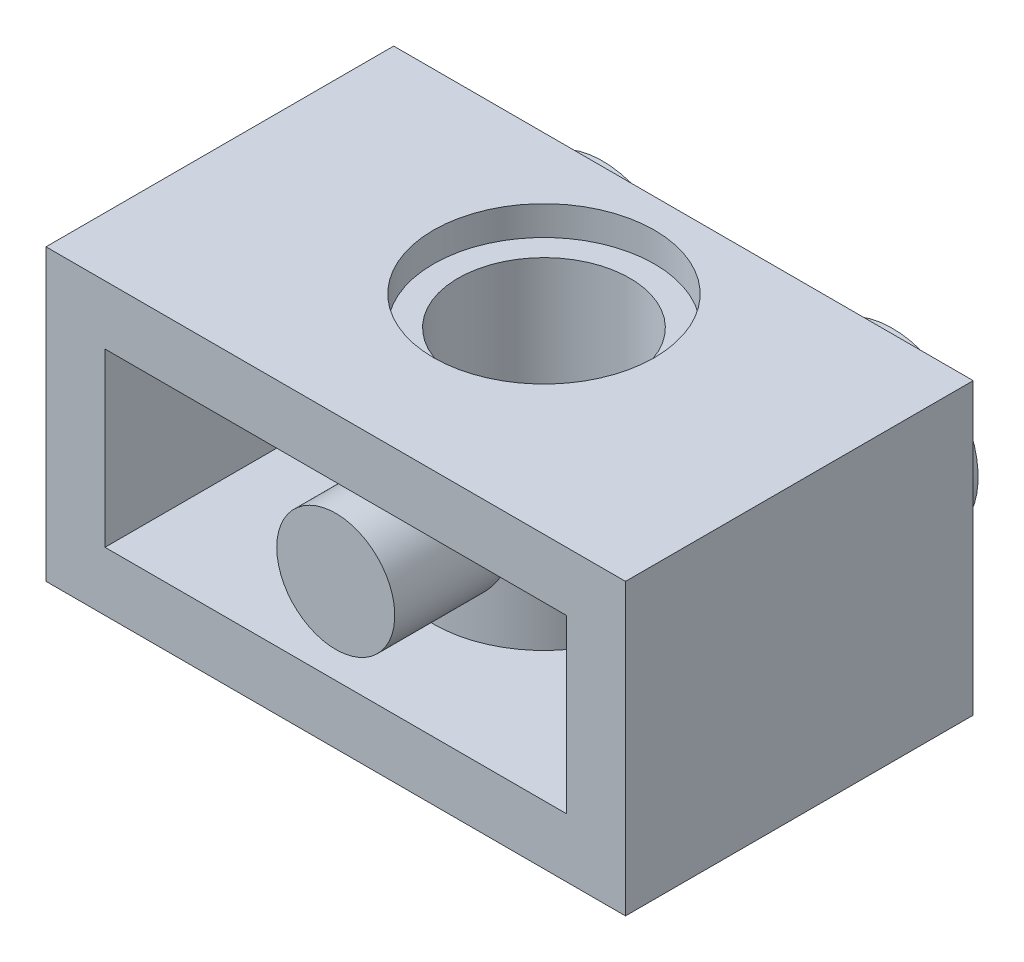
ISO-10303-21;
HEADER;
FILE_DESCRIPTION(('STEP AP214'),'2;1');
FILE_NAME('part.step','',(''),(''),'','','');
FILE_SCHEMA(('AUTOMOTIVE_DESIGN { 1 0 10303 214 1 1 1 1 }'));
ENDSEC;
DATA;
#1=APPLICATION_CONTEXT('core data for automotive mechanical design processes');
#2=APPLICATION_PROTOCOL_DEFINITION('international standard','automotive_design',2000,#1);
#3=PRODUCT_CONTEXT('',#1,'mechanical');
#4=PRODUCT('Part','Part','',(#3));
#5=PRODUCT_RELATED_PRODUCT_CATEGORY('part','',(#4));
#6=PRODUCT_DEFINITION_FORMATION('','',#4);
#7=PRODUCT_DEFINITION_CONTEXT('part definition',#1,'design');
#8=PRODUCT_DEFINITION('design','',#6,#7);
#9=PRODUCT_DEFINITION_SHAPE('','',#8);
#10=(LENGTH_UNIT() NAMED_UNIT(*) SI_UNIT(.MILLI.,.METRE.));
#11=(NAMED_UNIT(*) PLANE_ANGLE_UNIT() SI_UNIT($,.RADIAN.));
#12=(NAMED_UNIT(*) SI_UNIT($,.STERADIAN.) SOLID_ANGLE_UNIT());
#13=UNCERTAINTY_MEASURE_WITH_UNIT(LENGTH_MEASURE(1.E-05),#10,'distance_accuracy_value','');
#14=(GEOMETRIC_REPRESENTATION_CONTEXT(3) GLOBAL_UNCERTAINTY_ASSIGNED_CONTEXT((#13)) GLOBAL_UNIT_ASSIGNED_CONTEXT((#10,
#11,#12)) REPRESENTATION_CONTEXT('',''));
#15=CARTESIAN_POINT('',(0.,0.,0.));
#16=DIRECTION('',(0.,0.,1.));
#17=DIRECTION('',(1.,0.,0.));
#18=AXIS2_PLACEMENT_3D('',#15,#16,#17);
#19=CARTESIAN_POINT('',(6.4225,2.39,-3.1965));
#20=DIRECTION('',(0.,1.,0.));
#21=DIRECTION('',(0.,0.,1.));
#22=AXIS2_PLACEMENT_3D('',#19,#20,#21);
#23=PLANE('',#22);
#24=CARTESIAN_POINT('',(-7.50715418505547E-13,2.39,-0.955999999999999));
#25=DIRECTION('',(0.,-1.,0.));
#26=DIRECTION('',(0.,0.,1.));
#27=AXIS2_PLACEMENT_3D('',#24,#25,#26);
#28=CIRCLE('',#27,3.07500000000066);
#29=CARTESIAN_POINT('',(2.10613027849678,2.39,-3.1965));
#30=VERTEX_POINT('',#29);
#31=CARTESIAN_POINT('',(-2.10613027849828,2.39,-3.1965));
#32=VERTEX_POINT('',#31);
#33=EDGE_CURVE('E57',#30,#32,#28,.T.);
#34=ORIENTED_EDGE('',*,*,#33,.F.);
#35=DIRECTION('',(-1.,0.,0.));
#36=VECTOR('',#35,1.);
#37=CARTESIAN_POINT('',(6.4225,2.39,-3.1965));
#38=LINE('',#37,#36);
#39=CARTESIAN_POINT('',(6.4225,2.39,-3.1965));
#40=VERTEX_POINT('',#39);
#41=EDGE_CURVE('E145',#40,#30,#38,.T.);
#42=ORIENTED_EDGE('',*,*,#41,.F.);
#43=DIRECTION('',(0.,0.,1.));
#44=VECTOR('',#43,1.);
#45=CARTESIAN_POINT('',(6.4225,2.39,-3.1965));
#46=LINE('',#45,#44);
#47=CARTESIAN_POINT('',(6.4225,2.39,4.839));
#48=VERTEX_POINT('',#47);
#49=EDGE_CURVE('E162',#40,#48,#46,.T.);
#50=ORIENTED_EDGE('',*,*,#49,.T.);
#51=DIRECTION('',(-1.,0.,0.));
#52=VECTOR('',#51,1.);
#53=CARTESIAN_POINT('',(6.4225,2.39,4.839));
#54=LINE('',#53,#52);
#55=CARTESIAN_POINT('',(-6.4225,2.39,4.839));
#56=VERTEX_POINT('',#55);
#57=EDGE_CURVE('E156',#48,#56,#54,.T.);
#58=ORIENTED_EDGE('',*,*,#57,.T.);
#59=DIRECTION('',(0.,0.,1.));
#60=VECTOR('',#59,1.);
#61=CARTESIAN_POINT('',(-6.4225,2.39,-3.1965));
#62=LINE('',#61,#60);
#63=CARTESIAN_POINT('',(-6.4225,2.39,-3.1965));
#64=VERTEX_POINT('',#63);
#65=EDGE_CURVE('E159',#64,#56,#62,.T.);
#66=ORIENTED_EDGE('',*,*,#65,.F.);
#67=EDGE_CURVE('E141',#32,#64,#38,.T.);
#68=ORIENTED_EDGE('',*,*,#67,.F.);
#69=EDGE_LOOP('',(#34,#42,#50,#58,#66,#68));
#70=FACE_BOUND('',#69,.T.);
#71=ADVANCED_FACE('F37',(#70),#23,.F.);
#72=CARTESIAN_POINT('',(-6.4225,-2.39,-3.1965));
#73=DIRECTION('',(0.,-1.,0.));
#74=DIRECTION('',(0.,0.,-1.));
#75=AXIS2_PLACEMENT_3D('',#72,#73,#74);
#76=PLANE('',#75);
#77=CARTESIAN_POINT('',(-7.50715418505547E-13,-2.39,-0.955999999999999));
#78=DIRECTION('',(0.,-1.,0.));
#79=DIRECTION('',(0.,0.,1.));
#80=AXIS2_PLACEMENT_3D('',#77,#78,#79);
#81=CIRCLE('',#80,3.07500000000066);
#82=CARTESIAN_POINT('',(2.10613027849678,-2.39,-3.1965));
#83=VERTEX_POINT('',#82);
#84=CARTESIAN_POINT('',(-2.10613027849828,-2.39,-3.1965));
#85=VERTEX_POINT('',#84);
#86=EDGE_CURVE('E119',#83,#85,#81,.T.);
#87=ORIENTED_EDGE('',*,*,#86,.T.);
#88=DIRECTION('',(1.,0.,0.));
#89=VECTOR('',#88,1.);
#90=CARTESIAN_POINT('',(-6.4225,-2.39,-3.1965));
#91=LINE('',#90,#89);
#92=CARTESIAN_POINT('',(-6.4225,-2.39,-3.1965));
#93=VERTEX_POINT('',#92);
#94=EDGE_CURVE('E130',#93,#85,#91,.T.);
#95=ORIENTED_EDGE('',*,*,#94,.F.);
#96=DIRECTION('',(0.,0.,1.));
#97=VECTOR('',#96,1.);
#98=CARTESIAN_POINT('',(-6.4225,-2.39,-3.1965));
#99=LINE('',#98,#97);
#100=CARTESIAN_POINT('',(-6.4225,-2.39,4.839));
#101=VERTEX_POINT('',#100);
#102=EDGE_CURVE('E148',#93,#101,#99,.T.);
#103=ORIENTED_EDGE('',*,*,#102,.T.);
#104=DIRECTION('',(1.,0.,0.));
#105=VECTOR('',#104,1.);
#106=CARTESIAN_POINT('',(-6.4225,-2.39,4.839));
#107=LINE('',#106,#105);
#108=CARTESIAN_POINT('',(6.4225,-2.39,4.839));
#109=VERTEX_POINT('',#108);
#110=EDGE_CURVE('E150',#101,#109,#107,.T.);
#111=ORIENTED_EDGE('',*,*,#110,.T.);
#112=DIRECTION('',(0.,0.,1.));
#113=VECTOR('',#112,1.);
#114=CARTESIAN_POINT('',(6.4225,-2.39,-3.1965));
#115=LINE('',#114,#113);
#116=CARTESIAN_POINT('',(6.4225,-2.39,-3.1965));
#117=VERTEX_POINT('',#116);
#118=EDGE_CURVE('E164',#117,#109,#115,.T.);
#119=ORIENTED_EDGE('',*,*,#118,.F.);
#120=EDGE_CURVE('E133',#83,#117,#91,.T.);
#121=ORIENTED_EDGE('',*,*,#120,.F.);
#122=EDGE_LOOP('',(#87,#95,#103,#111,#119,#121));
#123=FACE_BOUND('',#122,.T.);
#124=ADVANCED_FACE('F129',(#123),#76,.F.);
#125=CARTESIAN_POINT('',(-6.4225,-2.39,-3.1965));
#126=DIRECTION('',(0.,0.,1.));
#127=DIRECTION('',(1.,0.,0.));
#128=AXIS2_PLACEMENT_3D('',#125,#126,#127);
#129=PLANE('',#128);
#130=ORIENTED_EDGE('',*,*,#41,.T.);
#131=DIRECTION('',(0.,1.,0.));
#132=VECTOR('',#131,1.);
#133=CARTESIAN_POINT('',(2.10613027849678,-2.39,-3.1965));
#134=LINE('',#133,#132);
#135=EDGE_CURVE('E124',#83,#30,#134,.T.);
#136=ORIENTED_EDGE('',*,*,#135,.F.);
#137=ORIENTED_EDGE('',*,*,#120,.T.);
#138=DIRECTION('',(0.,1.,0.));
#139=VECTOR('',#138,1.);
#140=CARTESIAN_POINT('',(6.4225,-2.39,-3.1965));
#141=LINE('',#140,#139);
#142=EDGE_CURVE('E138',#117,#40,#141,.T.);
#143=ORIENTED_EDGE('',*,*,#142,.T.);
#144=EDGE_LOOP('',(#130,#136,#137,#143));
#145=FACE_BOUND('',#144,.T.);
#146=ADVANCED_FACE('F244',(#145),#129,.T.);
#147=ORIENTED_EDGE('',*,*,#94,.T.);
#148=DIRECTION('',(0.,1.,0.));
#149=VECTOR('',#148,1.);
#150=CARTESIAN_POINT('',(-2.10613027849828,-2.39,-3.1965));
#151=LINE('',#150,#149);
#152=EDGE_CURVE('E116',#85,#32,#151,.T.);
#153=ORIENTED_EDGE('',*,*,#152,.T.);
#154=ORIENTED_EDGE('',*,*,#67,.T.);
#155=DIRECTION('',(0.,-1.,0.));
#156=VECTOR('',#155,1.);
#157=CARTESIAN_POINT('',(-6.4225,2.39,-3.1965));
#158=LINE('',#157,#156);
#159=EDGE_CURVE('E137',#64,#93,#158,.T.);
#160=ORIENTED_EDGE('',*,*,#159,.T.);
#161=EDGE_LOOP('',(#147,#153,#154,#160));
#162=FACE_BOUND('',#161,.T.);
#163=ADVANCED_FACE('F135',(#162),#129,.T.);
#164=CARTESIAN_POINT('',(-8.065,-4.0325,4.839));
#165=DIRECTION('',(0.,0.,1.));
#166=DIRECTION('',(1.,0.,0.));
#167=AXIS2_PLACEMENT_3D('',#164,#165,#166);
#168=PLANE('',#167);
#169=DIRECTION('',(0.,-1.,0.));
#170=VECTOR('',#169,1.);
#171=CARTESIAN_POINT('',(-6.4225,2.39,4.839));
#172=LINE('',#171,#170);
#173=EDGE_CURVE('E65',#56,#101,#172,.T.);
#174=ORIENTED_EDGE('',*,*,#173,.F.);
#175=ORIENTED_EDGE('',*,*,#57,.F.);
#176=DIRECTION('',(0.,1.,0.));
#177=VECTOR('',#176,1.);
#178=CARTESIAN_POINT('',(6.4225,-2.39,4.839));
#179=LINE('',#178,#177);
#180=EDGE_CURVE('E153',#109,#48,#179,.T.);
#181=ORIENTED_EDGE('',*,*,#180,.F.);
#182=ORIENTED_EDGE('',*,*,#110,.F.);
#183=EDGE_LOOP('',(#174,#175,#181,#182));
#184=FACE_BOUND('',#183,.T.);
#185=DIRECTION('',(1.,0.,0.));
#186=VECTOR('',#185,1.);
#187=CARTESIAN_POINT('',(-8.065,4.0325,4.839));
#188=LINE('',#187,#186);
#189=CARTESIAN_POINT('',(-8.065,4.0325,4.839));
#190=VERTEX_POINT('',#189);
#191=CARTESIAN_POINT('',(8.065,4.0325,4.839));
#192=VERTEX_POINT('',#191);
#193=EDGE_CURVE('E161',#190,#192,#188,.T.);
#194=ORIENTED_EDGE('',*,*,#193,.F.);
#195=DIRECTION('',(0.,1.,0.));
#196=VECTOR('',#195,1.);
#197=CARTESIAN_POINT('',(-8.065,-4.0325,4.839));
#198=LINE('',#197,#196);
#199=CARTESIAN_POINT('',(-8.065,-4.0325,4.839));
#200=VERTEX_POINT('',#199);
#201=EDGE_CURVE('E191',#200,#190,#198,.T.);
#202=ORIENTED_EDGE('',*,*,#201,.F.);
#203=DIRECTION('',(1.,0.,0.));
#204=VECTOR('',#203,1.);
#205=CARTESIAN_POINT('',(-8.065,-4.0325,4.839));
#206=LINE('',#205,#204);
#207=CARTESIAN_POINT('',(8.065,-4.0325,4.839));
#208=VERTEX_POINT('',#207);
#209=EDGE_CURVE('E167',#200,#208,#206,.T.);
#210=ORIENTED_EDGE('',*,*,#209,.T.);
#211=DIRECTION('',(0.,1.,0.));
#212=VECTOR('',#211,1.);
#213=CARTESIAN_POINT('',(8.065,-4.0325,4.839));
#214=LINE('',#213,#212);
#215=EDGE_CURVE('E180',#208,#192,#214,.T.);
#216=ORIENTED_EDGE('',*,*,#215,.T.);
#217=EDGE_LOOP('',(#194,#202,#210,#216));
#218=FACE_BOUND('',#217,.T.);
#219=ADVANCED_FACE('F39',(#184,#218),#168,.T.);
#220=CARTESIAN_POINT('',(-8.065,-4.0325,-4.839));
#221=DIRECTION('',(-1.,0.,0.));
#222=DIRECTION('',(0.,0.,1.));
#223=AXIS2_PLACEMENT_3D('',#220,#221,#222);
#224=PLANE('',#223);
#225=DIRECTION('',(0.,0.,1.));
#226=VECTOR('',#225,1.);
#227=CARTESIAN_POINT('',(-8.065,4.0325,-4.839));
#228=LINE('',#227,#226);
#229=CARTESIAN_POINT('',(-8.065,4.0325,-4.839));
#230=VERTEX_POINT('',#229);
#231=EDGE_CURVE('E171',#230,#190,#228,.T.);
#232=ORIENTED_EDGE('',*,*,#231,.F.);
#233=DIRECTION('',(0.,1.,0.));
#234=VECTOR('',#233,1.);
#235=CARTESIAN_POINT('',(-8.065,-4.0325,-4.839));
#236=LINE('',#235,#234);
#237=CARTESIAN_POINT('',(-8.065,-4.0325,-4.839));
#238=VERTEX_POINT('',#237);
#239=EDGE_CURVE('E194',#238,#230,#236,.T.);
#240=ORIENTED_EDGE('',*,*,#239,.F.);
#241=DIRECTION('',(0.,0.,1.));
#242=VECTOR('',#241,1.);
#243=CARTESIAN_POINT('',(-8.065,-4.0325,-4.839));
#244=LINE('',#243,#242);
#245=EDGE_CURVE('E177',#238,#200,#244,.T.);
#246=ORIENTED_EDGE('',*,*,#245,.T.);
#247=ORIENTED_EDGE('',*,*,#201,.T.);
#248=EDGE_LOOP('',(#232,#240,#246,#247));
#249=FACE_BOUND('',#248,.T.);
#250=ADVANCED_FACE('F210',(#249),#224,.T.);
#251=CARTESIAN_POINT('',(8.065,-4.0325,-4.839));
#252=DIRECTION('',(0.,0.,-1.));
#253=DIRECTION('',(-1.,0.,0.));
#254=AXIS2_PLACEMENT_3D('',#251,#252,#253);
#255=PLANE('',#254);
#256=CARTESIAN_POINT('',(-4.0325,0.,-4.839));
#257=DIRECTION('',(0.,0.,-1.));
#258=DIRECTION('',(-1.,0.,0.));
#259=AXIS2_PLACEMENT_3D('',#256,#257,#258);
#260=CIRCLE('',#259,2.39);
#261=CARTESIAN_POINT('',(-6.4225,0.,-4.839));
#262=VERTEX_POINT('',#261);
#263=EDGE_CURVE('E50',#262,#262,#260,.T.);
#264=ORIENTED_EDGE('',*,*,#263,.F.);
#265=EDGE_LOOP('',(#264));
#266=FACE_BOUND('',#265,.T.);
#267=CARTESIAN_POINT('',(4.0325,0.,-4.839));
#268=DIRECTION('',(0.,0.,-1.));
#269=DIRECTION('',(-1.,0.,0.));
#270=AXIS2_PLACEMENT_3D('',#267,#268,#269);
#271=CIRCLE('',#270,2.39);
#272=CARTESIAN_POINT('',(1.6425,0.,-4.839));
#273=VERTEX_POINT('',#272);
#274=EDGE_CURVE('E193',#273,#273,#271,.T.);
#275=ORIENTED_EDGE('',*,*,#274,.F.);
#276=EDGE_LOOP('',(#275));
#277=FACE_BOUND('',#276,.T.);
#278=DIRECTION('',(-1.,0.,0.));
#279=VECTOR('',#278,1.);
#280=CARTESIAN_POINT('',(8.065,4.0325,-4.839));
#281=LINE('',#280,#279);
#282=CARTESIAN_POINT('',(8.065,4.0325,-4.839));
#283=VERTEX_POINT('',#282);
#284=EDGE_CURVE('E186',#283,#230,#281,.T.);
#285=ORIENTED_EDGE('',*,*,#284,.F.);
#286=DIRECTION('',(0.,1.,0.));
#287=VECTOR('',#286,1.);
#288=CARTESIAN_POINT('',(8.065,-4.0325,-4.839));
#289=LINE('',#288,#287);
#290=CARTESIAN_POINT('',(8.065,-4.0325,-4.839));
#291=VERTEX_POINT('',#290);
#292=EDGE_CURVE('E196',#291,#283,#289,.T.);
#293=ORIENTED_EDGE('',*,*,#292,.F.);
#294=DIRECTION('',(-1.,0.,0.));
#295=VECTOR('',#294,1.);
#296=CARTESIAN_POINT('',(8.065,-4.0325,-4.839));
#297=LINE('',#296,#295);
#298=EDGE_CURVE('E174',#291,#238,#297,.T.);
#299=ORIENTED_EDGE('',*,*,#298,.T.);
#300=ORIENTED_EDGE('',*,*,#239,.T.);
#301=EDGE_LOOP('',(#285,#293,#299,#300));
#302=FACE_BOUND('',#301,.T.);
#303=ADVANCED_FACE('F206',(#266,#277,#302),#255,.T.);
#304=CARTESIAN_POINT('',(8.065,-4.0325,4.839));
#305=DIRECTION('',(1.,0.,0.));
#306=DIRECTION('',(0.,0.,-1.));
#307=AXIS2_PLACEMENT_3D('',#304,#305,#306);
#308=PLANE('',#307);
#309=DIRECTION('',(0.,0.,-1.));
#310=VECTOR('',#309,1.);
#311=CARTESIAN_POINT('',(8.065,4.0325,4.839));
#312=LINE('',#311,#310);
#313=EDGE_CURVE('E183',#192,#283,#312,.T.);
#314=ORIENTED_EDGE('',*,*,#313,.F.);
#315=ORIENTED_EDGE('',*,*,#215,.F.);
#316=DIRECTION('',(0.,0.,-1.));
#317=VECTOR('',#316,1.);
#318=CARTESIAN_POINT('',(8.065,-4.0325,4.839));
#319=LINE('',#318,#317);
#320=EDGE_CURVE('E170',#208,#291,#319,.T.);
#321=ORIENTED_EDGE('',*,*,#320,.T.);
#322=ORIENTED_EDGE('',*,*,#292,.T.);
#323=EDGE_LOOP('',(#314,#315,#321,#322));
#324=FACE_BOUND('',#323,.T.);
#325=ADVANCED_FACE('F209',(#324),#308,.T.);
#326=CARTESIAN_POINT('',(8.065,-4.0325,4.839));
#327=DIRECTION('',(0.,1.,0.));
#328=DIRECTION('',(0.,0.,1.));
#329=AXIS2_PLACEMENT_3D('',#326,#327,#328);
#330=PLANE('',#329);
#331=CARTESIAN_POINT('',(0.,-4.03249999999954,-0.956));
#332=DIRECTION('',(0.,1.,0.));
#333=DIRECTION('',(0.,0.,1.));
#334=AXIS2_PLACEMENT_3D('',#331,#332,#333);
#335=CIRCLE('',#334,3.075);
#336=CARTESIAN_POINT('',(0.,-4.03249999999954,2.119));
#337=VERTEX_POINT('',#336);
#338=EDGE_CURVE('E265',#337,#337,#335,.T.);
#339=ORIENTED_EDGE('',*,*,#338,.T.);
#340=EDGE_LOOP('',(#339));
#341=FACE_BOUND('',#340,.T.);
#342=ORIENTED_EDGE('',*,*,#209,.F.);
#343=ORIENTED_EDGE('',*,*,#245,.F.);
#344=ORIENTED_EDGE('',*,*,#298,.F.);
#345=ORIENTED_EDGE('',*,*,#320,.F.);
#346=EDGE_LOOP('',(#342,#343,#344,#345));
#347=FACE_BOUND('',#346,.T.);
#348=ADVANCED_FACE('F225',(#341,#347),#330,.F.);
#349=CARTESIAN_POINT('',(8.065,4.0325,4.839));
#350=DIRECTION('',(0.,1.,0.));
#351=DIRECTION('',(0.,0.,1.));
#352=AXIS2_PLACEMENT_3D('',#349,#350,#351);
#353=PLANE('',#352);
#354=CARTESIAN_POINT('',(0.,4.0325,-0.956));
#355=DIRECTION('',(0.,1.,0.));
#356=DIRECTION('',(0.,0.,1.));
#357=AXIS2_PLACEMENT_3D('',#354,#355,#356);
#358=CIRCLE('',#357,3.075);
#359=CARTESIAN_POINT('',(0.,4.0325,2.119));
#360=VERTEX_POINT('',#359);
#361=EDGE_CURVE('E263',#360,#360,#358,.T.);
#362=ORIENTED_EDGE('',*,*,#361,.F.);
#363=EDGE_LOOP('',(#362));
#364=FACE_BOUND('',#363,.T.);
#365=ORIENTED_EDGE('',*,*,#193,.T.);
#366=ORIENTED_EDGE('',*,*,#313,.T.);
#367=ORIENTED_EDGE('',*,*,#284,.T.);
#368=ORIENTED_EDGE('',*,*,#231,.T.);
#369=EDGE_LOOP('',(#365,#366,#367,#368));
#370=FACE_BOUND('',#369,.T.);
#371=ADVANCED_FACE('F219',(#364,#370),#353,.T.);
#372=CARTESIAN_POINT('',(-6.4225,2.39,-3.1965));
#373=DIRECTION('',(-1.,0.,0.));
#374=DIRECTION('',(0.,0.,1.));
#375=AXIS2_PLACEMENT_3D('',#372,#373,#374);
#376=PLANE('',#375);
#377=ORIENTED_EDGE('',*,*,#173,.T.);
#378=ORIENTED_EDGE('',*,*,#102,.F.);
#379=ORIENTED_EDGE('',*,*,#159,.F.);
#380=ORIENTED_EDGE('',*,*,#65,.T.);
#381=EDGE_LOOP('',(#377,#378,#379,#380));
#382=FACE_BOUND('',#381,.T.);
#383=ADVANCED_FACE('F249',(#382),#376,.F.);
#384=CARTESIAN_POINT('',(6.4225,-2.39,-3.1965));
#385=DIRECTION('',(1.,0.,0.));
#386=DIRECTION('',(0.,0.,-1.));
#387=AXIS2_PLACEMENT_3D('',#384,#385,#386);
#388=PLANE('',#387);
#389=ORIENTED_EDGE('',*,*,#180,.T.);
#390=ORIENTED_EDGE('',*,*,#49,.F.);
#391=ORIENTED_EDGE('',*,*,#142,.F.);
#392=ORIENTED_EDGE('',*,*,#118,.T.);
#393=EDGE_LOOP('',(#389,#390,#391,#392));
#394=FACE_BOUND('',#393,.T.);
#395=ADVANCED_FACE('F248',(#394),#388,.F.);
#396=CARTESIAN_POINT('',(-7.50715418505547E-13,-2.39,-0.955999999999999));
#397=DIRECTION('',(0.,1.,0.));
#398=DIRECTION('',(0.,0.,1.));
#399=AXIS2_PLACEMENT_3D('',#396,#397,#398);
#400=CYLINDRICAL_SURFACE('',#399,3.07500000000066);
#401=CARTESIAN_POINT('',(-1.642500000002,0.,1.64358049500299));
#402=CARTESIAN_POINT('',(-1.64249355963965,0.0846419026282318,1.64358916394284));
#403=CARTESIAN_POINT('',(-1.63591238827722,0.169368950769577,1.64777900722416));
#404=CARTESIAN_POINT('',(-1.60995885113341,0.336145632385499,1.6638997575945));
#405=CARTESIAN_POINT('',(-1.59056329685434,0.418190128607937,1.6758446973779));
#406=CARTESIAN_POINT('',(-1.54010667036438,0.576863014816299,1.70568018612205));
#407=CARTESIAN_POINT('',(-1.50911470334276,0.653520355477511,1.72353544309204));
#408=CARTESIAN_POINT('',(-1.43655730286428,0.800522778186878,1.76312331907909));
#409=CARTESIAN_POINT('',(-1.39499012967829,0.870866819054646,1.78485657589078));
#410=CARTESIAN_POINT('',(-1.29784578447152,1.01060043602089,1.83226250452832));
#411=CARTESIAN_POINT('',(-1.24131334828299,1.07926575144692,1.85811329479609));
#412=CARTESIAN_POINT('',(-1.11782055158812,1.20671592983289,1.90941021060064));
#413=CARTESIAN_POINT('',(-1.05085435396606,1.26549522359657,1.9348561007821));
#414=CARTESIAN_POINT('',(-0.901893164830069,1.37610494421595,1.98489422452432));
#415=CARTESIAN_POINT('',(-0.819126026503318,1.42700919593315,2.00925709420416));
#416=CARTESIAN_POINT('',(-0.644655610072859,1.51383563979799,2.05200360274914));
#417=CARTESIAN_POINT('',(-0.552958815115922,1.54976860287972,2.07039153811345));
#418=CARTESIAN_POINT('',(-0.370934604110247,1.60264433236737,2.09782050960068));
#419=CARTESIAN_POINT('',(-0.281075659912394,1.62086749020276,2.10748733193658));
#420=CARTESIAN_POINT('',(-0.0990998783825199,1.64205935256234,2.1187507369049));
#421=CARTESIAN_POINT('',(-0.00698468219320846,1.64503883221442,2.12035302001473));
#422=CARTESIAN_POINT('',(0.167108465501163,1.63606845900737,2.11556844844074));
#423=CARTESIAN_POINT('',(0.249187869388309,1.6255661924578,2.10995616398045));
#424=CARTESIAN_POINT('',(0.410212817337773,1.59257235871997,2.09259130373503));
#425=CARTESIAN_POINT('',(0.48915812265301,1.57007988002589,2.08083826112574));
#426=CARTESIAN_POINT('',(0.642909648294374,1.51369193877814,2.05207063754082));
#427=CARTESIAN_POINT('',(0.717655207896924,1.47966355768143,2.03499492148947));
#428=CARTESIAN_POINT('',(0.860534101925611,1.40140282596245,1.99706248974018));
#429=CARTESIAN_POINT('',(0.928665211375959,1.35716705854914,1.97620450847948));
#430=CARTESIAN_POINT('',(1.06393823224453,1.25450421083381,1.93004960331237));
#431=CARTESIAN_POINT('',(1.13024370396798,1.19508079168666,1.90451665249137));
#432=CARTESIAN_POINT('',(1.25243029556411,1.06635451109776,1.8531715785278));
#433=CARTESIAN_POINT('',(1.30830145447099,0.99704231967537,1.82735921325894));
#434=CARTESIAN_POINT('',(1.41245119312353,0.843821555181214,1.77607592730517));
#435=CARTESIAN_POINT('',(1.45977043813136,0.75919007682611,1.75079599522106));
#436=CARTESIAN_POINT('',(1.53916473892437,0.581560779333853,1.7064579348625));
#437=CARTESIAN_POINT('',(1.57125710646205,0.488572604912981,1.6873927486735));
#438=CARTESIAN_POINT('',(1.61653373696232,0.304698947010788,1.65993159321946));
#439=CARTESIAN_POINT('',(1.6310408842272,0.214255026304593,1.6507954612858));
#440=CARTESIAN_POINT('',(1.64473161869438,0.0317928283797412,1.64218431607379));
#441=CARTESIAN_POINT('',(1.64393018331642,-0.0602238220543194,1.64269985989973));
#442=CARTESIAN_POINT('',(1.62823947440064,-0.230074393496914,1.65254642362771));
#443=CARTESIAN_POINT('',(1.61524121531727,-0.308164659327785,1.66069389044483));
#444=CARTESIAN_POINT('',(1.57847518204379,-0.460861071827728,1.68303399198333));
#445=CARTESIAN_POINT('',(1.55470316340136,-0.535465832550139,1.69722900907766));
#446=CARTESIAN_POINT('',(1.49601284023467,-0.682881043721599,1.73077411239738));
#447=CARTESIAN_POINT('',(1.46064831663024,-0.755466439254046,1.75032431865995));
#448=CARTESIAN_POINT('',(1.38015035359206,-0.894105602880898,1.79224834243478));
#449=CARTESIAN_POINT('',(1.33501194901684,-0.96015602626458,1.81462359265476));
#450=CARTESIAN_POINT('',(1.22848264373521,-1.09407336520008,1.86364105237553));
#451=CARTESIAN_POINT('',(1.16567590476653,-1.16076735231783,1.89042532745651));
#452=CARTESIAN_POINT('',(1.02947943207752,-1.28310622241465,1.94246745277441));
#453=CARTESIAN_POINT('',(0.95608443308673,-1.33874557528915,1.96772453465674));
#454=CARTESIAN_POINT('',(0.796771661501489,-1.43951553647144,2.01518906271895));
#455=CARTESIAN_POINT('',(0.710457554932259,-1.4841069966937,2.03722399570713));
#456=CARTESIAN_POINT('',(0.530040282868016,-1.55766718297396,2.07436838554382));
#457=CARTESIAN_POINT('',(0.435944949409149,-1.58665140261646,2.08948470837394));
#458=CARTESIAN_POINT('',(0.252679948019545,-1.62537522298606,2.10984790301948));
#459=CARTESIAN_POINT('',(0.163945173655544,-1.63673626822429,2.11592384895147));
#460=CARTESIAN_POINT('',(-0.0143658567081445,-1.64485649102825,2.12025686090633));
#461=CARTESIAN_POINT('',(-0.103941703959649,-1.6416224287221,2.11851754678487));
#462=CARTESIAN_POINT('',(-0.273648269704471,-1.62161240655592,2.10788411595885));
#463=CARTESIAN_POINT('',(-0.353953677750068,-1.60596187450528,2.09958481756334));
#464=CARTESIAN_POINT('',(-0.510623379785833,-1.56322280176614,2.07734008857775));
#465=CARTESIAN_POINT('',(-0.586987174919382,-1.53613281724681,2.06339394528011));
#466=CARTESIAN_POINT('',(-0.736876335932698,-1.47029692546774,2.03042770960216));
#467=CARTESIAN_POINT('',(-0.81018741419228,-1.43115149995082,2.01123673975591));
#468=CARTESIAN_POINT('',(-0.949465669868662,-1.34280704877779,1.96965058588222));
#469=CARTESIAN_POINT('',(-1.01542967145505,-1.29360370136239,1.94725402569842));
#470=CARTESIAN_POINT('',(-1.14586740068001,-1.18028030523328,1.89846667251818));
#471=CARTESIAN_POINT('',(-1.20936982103126,-1.11511244588616,1.87190805555452));
#472=CARTESIAN_POINT('',(-1.32498379977393,-0.974929834968531,1.8196222373584));
#473=CARTESIAN_POINT('',(-1.37708271338508,-0.899904298697062,1.79389598575151));
#474=CARTESIAN_POINT('',(-1.47104522352846,-0.736988275974901,1.74485399494023));
#475=CARTESIAN_POINT('',(-1.51219581638133,-0.648619367138979,1.72174618365607));
#476=CARTESIAN_POINT('',(-1.57842411964503,-0.464616371257816,1.68326126327655));
#477=CARTESIAN_POINT('',(-1.60355434999283,-0.369007185657274,1.66785892925228));
#478=CARTESIAN_POINT('',(-1.62740029611988,-0.226806570861234,1.65307237115542));
#479=CARTESIAN_POINT('',(-1.63305062023679,-0.181714126724428,1.64953073727614));
#480=CARTESIAN_POINT('',(-1.64060227228953,-0.0910893542032187,1.64478242457749));
#481=CARTESIAN_POINT('',(-1.64250346641336,-0.0455570101764206,1.64357582909913));
#482=CARTESIAN_POINT('',(-1.642500000002,0.,1.64358049500299));
#483=B_SPLINE_CURVE_WITH_KNOTS('',3,(#401,#402,#403,#404,#405,#406,#407,#408,#409,#410,#411,
#412,#413,#414,#415,#416,#417,#418,#419,#420,#421,#422,#423,#424,#425,#426,#427,#428,#429,#430,
#431,#432,#433,#434,#435,#436,#437,#438,#439,#440,#441,#442,#443,#444,#445,#446,#447,#448,#449,
#450,#451,#452,#453,#454,#455,#456,#457,#458,#459,#460,#461,#462,#463,#464,#465,#466,#467,#468,
#469,#470,#471,#472,#473,#474,#475,#476,#477,#478,#479,#480,#481,#482),.UNSPECIFIED.,.T.,.F.,(4,
2,2,2,2,2,2,2,2,2,2,2,2,2,2,2,2,2,2,2,2,2,2,2,2,2,2,2,2,2,2,2,2,2,2,2,2,2,2,2,4),(0.,
0.253733028562708,0.507926466503564,0.760628637724607,1.0133724079389,1.29010443855302,
1.56699184512131,1.86592985122744,2.164652416645,2.43967655199714,2.71450625723699,
2.96215112198148,3.20981481557846,3.46043501022845,3.7111392187704,3.9878613282277,
4.26484627099156,4.5638952867901,4.86260348800741,5.13707522082567,5.41127843318709,
5.64895211863048,5.88671951998687,6.13499611458347,6.38339913108662,6.66849569748232,
6.95373452692979,7.25094649153692,7.54786286205283,7.81537788160388,8.08276900688783,
8.32836240144069,8.57398680284013,8.8288353017942,9.08379353691664,9.36694361350761,
9.65040608816907,9.94932496360272,10.2472587772026,10.3838212274598,10.5203885517447),.UNSPECIFIED.);
#484=CARTESIAN_POINT('',(-1.642500000002,0.,1.64358049500299));
#485=VERTEX_POINT('',#484);
#486=EDGE_CURVE('E11',#485,#485,#483,.T.);
#487=ORIENTED_EDGE('',*,*,#486,.T.);
#488=EDGE_LOOP('',(#487));
#489=FACE_BOUND('',#488,.T.);
#490=ORIENTED_EDGE('',*,*,#33,.T.);
#491=ORIENTED_EDGE('',*,*,#152,.F.);
#492=ORIENTED_EDGE('',*,*,#86,.F.);
#493=ORIENTED_EDGE('',*,*,#135,.T.);
#494=EDGE_LOOP('',(#490,#491,#492,#493));
#495=FACE_BOUND('',#494,.T.);
#496=ADVANCED_FACE('F118',(#489,#495),#400,.T.);
#497=CARTESIAN_POINT('',(4.0325,0.,-4.839));
#498=DIRECTION('',(0.,0.,-1.));
#499=DIRECTION('',(-1.,0.,0.));
#500=AXIS2_PLACEMENT_3D('',#497,#498,#499);
#501=CYLINDRICAL_SURFACE('',#500,2.39);
#502=ORIENTED_EDGE('',*,*,#274,.T.);
#503=EDGE_LOOP('',(#502));
#504=FACE_BOUND('',#503,.T.);
#505=CARTESIAN_POINT('',(4.0325,0.,-6.61899999999994));
#506=DIRECTION('',(0.,0.,-1.));
#507=DIRECTION('',(-1.,0.,0.));
#508=AXIS2_PLACEMENT_3D('',#505,#506,#507);
#509=CIRCLE('',#508,2.39);
#510=CARTESIAN_POINT('',(1.6425,0.,-6.61899999999994));
#511=VERTEX_POINT('',#510);
#512=EDGE_CURVE('E278',#511,#511,#509,.T.);
#513=ORIENTED_EDGE('',*,*,#512,.F.);
#514=EDGE_LOOP('',(#513));
#515=FACE_BOUND('',#514,.T.);
#516=ADVANCED_FACE('F299',(#504,#515),#501,.T.);
#517=CARTESIAN_POINT('',(4.0325,0.,-6.61899999999997));
#518=DIRECTION('',(0.,0.,-1.));
#519=DIRECTION('',(-1.,0.,0.));
#520=AXIS2_PLACEMENT_3D('',#517,#518,#519);
#521=PLANE('',#520);
#522=CARTESIAN_POINT('',(4.0325,0.,-6.61899999999997));
#523=DIRECTION('',(0.,0.,-1.));
#524=DIRECTION('',(-1.,0.,0.));
#525=AXIS2_PLACEMENT_3D('',#522,#523,#524);
#526=CIRCLE('',#525,1.64249999999999);
#527=CARTESIAN_POINT('',(2.39000000000001,0.,-6.61899999999997));
#528=VERTEX_POINT('',#527);
#529=EDGE_CURVE('E464',#528,#528,#526,.T.);
#530=ORIENTED_EDGE('',*,*,#529,.F.);
#531=EDGE_LOOP('',(#530));
#532=FACE_BOUND('',#531,.T.);
#533=ORIENTED_EDGE('',*,*,#512,.T.);
#534=EDGE_LOOP('',(#533));
#535=FACE_BOUND('',#534,.T.);
#536=ADVANCED_FACE('F302',(#532,#535),#521,.T.);
#537=CARTESIAN_POINT('',(-4.0325,0.,-4.839));
#538=DIRECTION('',(0.,0.,-1.));
#539=DIRECTION('',(-1.,0.,0.));
#540=AXIS2_PLACEMENT_3D('',#537,#538,#539);
#541=CYLINDRICAL_SURFACE('',#540,2.39);
#542=ORIENTED_EDGE('',*,*,#263,.T.);
#543=EDGE_LOOP('',(#542));
#544=FACE_BOUND('',#543,.T.);
#545=CARTESIAN_POINT('',(-4.0325,0.,-6.61899999999994));
#546=DIRECTION('',(0.,0.,-1.));
#547=DIRECTION('',(-1.,0.,0.));
#548=AXIS2_PLACEMENT_3D('',#545,#546,#547);
#549=CIRCLE('',#548,2.39);
#550=CARTESIAN_POINT('',(-6.4225,0.,-6.61899999999994));
#551=VERTEX_POINT('',#550);
#552=EDGE_CURVE('E269',#551,#551,#549,.T.);
#553=ORIENTED_EDGE('',*,*,#552,.F.);
#554=EDGE_LOOP('',(#553));
#555=FACE_BOUND('',#554,.T.);
#556=ADVANCED_FACE('F203',(#544,#555),#541,.T.);
#557=CARTESIAN_POINT('',(-4.0325,0.,-6.61899999999997));
#558=DIRECTION('',(0.,0.,-1.));
#559=DIRECTION('',(-1.,0.,0.));
#560=AXIS2_PLACEMENT_3D('',#557,#558,#559);
#561=PLANE('',#560);
#562=CARTESIAN_POINT('',(-4.0325,0.,-6.61899999999997));
#563=DIRECTION('',(0.,0.,-1.));
#564=DIRECTION('',(-1.,0.,0.));
#565=AXIS2_PLACEMENT_3D('',#562,#563,#564);
#566=CIRCLE('',#565,1.64249999999999);
#567=CARTESIAN_POINT('',(-5.67499999999999,0.,-6.61899999999997));
#568=VERTEX_POINT('',#567);
#569=EDGE_CURVE('E475',#568,#568,#566,.T.);
#570=ORIENTED_EDGE('',*,*,#569,.F.);
#571=EDGE_LOOP('',(#570));
#572=FACE_BOUND('',#571,.T.);
#573=ORIENTED_EDGE('',*,*,#552,.T.);
#574=EDGE_LOOP('',(#573));
#575=FACE_BOUND('',#574,.T.);
#576=ADVANCED_FACE('F317',(#572,#575),#561,.T.);
#577=CARTESIAN_POINT('',(0.,-4.03249999999954,-0.956));
#578=DIRECTION('',(0.,1.,0.));
#579=DIRECTION('',(0.,0.,1.));
#580=AXIS2_PLACEMENT_3D('',#577,#578,#579);
#581=CYLINDRICAL_SURFACE('',#580,3.075);
#582=ORIENTED_EDGE('',*,*,#338,.F.);
#583=EDGE_LOOP('',(#582));
#584=FACE_BOUND('',#583,.T.);
#585=CARTESIAN_POINT('',(0.,-3.2175,-0.956));
#586=DIRECTION('',(0.,1.,0.));
#587=DIRECTION('',(0.,0.,1.));
#588=AXIS2_PLACEMENT_3D('',#585,#586,#587);
#589=CIRCLE('',#588,3.075);
#590=CARTESIAN_POINT('',(0.,-3.2175,2.119));
#591=VERTEX_POINT('',#590);
#592=EDGE_CURVE('E481',#591,#591,#589,.T.);
#593=ORIENTED_EDGE('',*,*,#592,.T.);
#594=EDGE_LOOP('',(#593));
#595=FACE_BOUND('',#594,.T.);
#596=ADVANCED_FACE('F351',(#584,#595),#581,.F.);
#597=CARTESIAN_POINT('',(0.,-4.03249999999954,-0.956));
#598=DIRECTION('',(0.,1.,0.));
#599=DIRECTION('',(0.,0.,1.));
#600=AXIS2_PLACEMENT_3D('',#597,#598,#599);
#601=CYLINDRICAL_SURFACE('',#600,3.075);
#602=CARTESIAN_POINT('',(0.,3.21750000000046,-0.956));
#603=DIRECTION('',(0.,1.,0.));
#604=DIRECTION('',(0.,0.,1.));
#605=AXIS2_PLACEMENT_3D('',#602,#603,#604);
#606=CIRCLE('',#605,3.075);
#607=CARTESIAN_POINT('',(0.,3.21750000000046,2.119));
#608=VERTEX_POINT('',#607);
#609=EDGE_CURVE('E266',#608,#608,#606,.T.);
#610=ORIENTED_EDGE('',*,*,#609,.F.);
#611=EDGE_LOOP('',(#610));
#612=FACE_BOUND('',#611,.T.);
#613=ORIENTED_EDGE('',*,*,#361,.T.);
#614=EDGE_LOOP('',(#613));
#615=FACE_BOUND('',#614,.T.);
#616=ADVANCED_FACE('F359',(#612,#615),#601,.F.);
#617=CARTESIAN_POINT('',(3.075,3.21750000000046,-0.956));
#618=DIRECTION('',(0.,-1.,0.));
#619=DIRECTION('',(0.,0.,-1.));
#620=AXIS2_PLACEMENT_3D('',#617,#618,#619);
#621=PLANE('',#620);
#622=CARTESIAN_POINT('',(0.,3.21750000000046,-0.956));
#623=DIRECTION('',(0.,1.,0.));
#624=DIRECTION('',(0.,0.,1.));
#625=AXIS2_PLACEMENT_3D('',#622,#623,#624);
#626=CIRCLE('',#625,2.39);
#627=CARTESIAN_POINT('',(0.,3.21750000000046,1.434));
#628=VERTEX_POINT('',#627);
#629=EDGE_CURVE('E272',#628,#628,#626,.T.);
#630=ORIENTED_EDGE('',*,*,#629,.F.);
#631=EDGE_LOOP('',(#630));
#632=FACE_BOUND('',#631,.T.);
#633=ORIENTED_EDGE('',*,*,#609,.T.);
#634=EDGE_LOOP('',(#633));
#635=FACE_BOUND('',#634,.T.);
#636=ADVANCED_FACE('F367',(#632,#635),#621,.F.);
#637=CARTESIAN_POINT('',(0.,-4.03249999999954,-0.956));
#638=DIRECTION('',(0.,1.,0.));
#639=DIRECTION('',(0.,0.,1.));
#640=AXIS2_PLACEMENT_3D('',#637,#638,#639);
#641=CYLINDRICAL_SURFACE('',#640,2.39);
#642=CARTESIAN_POINT('',(0.,-3.21749999999999,-0.956));
#643=DIRECTION('',(0.,1.,0.));
#644=DIRECTION('',(0.,0.,1.));
#645=AXIS2_PLACEMENT_3D('',#642,#643,#644);
#646=CIRCLE('',#645,2.39);
#647=CARTESIAN_POINT('',(0.,-3.21749999999999,1.434));
#648=VERTEX_POINT('',#647);
#649=EDGE_CURVE('E484',#648,#648,#646,.T.);
#650=ORIENTED_EDGE('',*,*,#649,.F.);
#651=EDGE_LOOP('',(#650));
#652=FACE_BOUND('',#651,.T.);
#653=ORIENTED_EDGE('',*,*,#629,.T.);
#654=EDGE_LOOP('',(#653));
#655=FACE_BOUND('',#654,.T.);
#656=ADVANCED_FACE('F375',(#652,#655),#641,.F.);
#657=CARTESIAN_POINT('',(2.39,-3.2175,-0.956));
#658=DIRECTION('',(0.,1.,0.));
#659=DIRECTION('',(0.,0.,1.));
#660=AXIS2_PLACEMENT_3D('',#657,#658,#659);
#661=PLANE('',#660);
#662=ORIENTED_EDGE('',*,*,#592,.F.);
#663=EDGE_LOOP('',(#662));
#664=FACE_BOUND('',#663,.T.);
#665=ORIENTED_EDGE('',*,*,#649,.T.);
#666=EDGE_LOOP('',(#665));
#667=FACE_BOUND('',#666,.T.);
#668=ADVANCED_FACE('F383',(#664,#667),#661,.F.);
#669=CARTESIAN_POINT('',(0.,0.,4.83900000000005));
#670=DIRECTION('',(0.,0.,-1.));
#671=DIRECTION('',(-1.,0.,0.));
#672=AXIS2_PLACEMENT_3D('',#669,#670,#671);
#673=CYLINDRICAL_SURFACE('',#672,1.6425);
#674=CARTESIAN_POINT('',(0.,0.,4.83900000000005));
#675=DIRECTION('',(0.,0.,-1.));
#676=DIRECTION('',(-1.,0.,0.));
#677=AXIS2_PLACEMENT_3D('',#674,#675,#676);
#678=CIRCLE('',#677,1.6425);
#679=CARTESIAN_POINT('',(-1.6425,0.,4.83900000000005));
#680=VERTEX_POINT('',#679);
#681=EDGE_CURVE('E472',#680,#680,#678,.T.);
#682=ORIENTED_EDGE('',*,*,#681,.T.);
#683=EDGE_LOOP('',(#682));
#684=FACE_BOUND('',#683,.T.);
#685=ORIENTED_EDGE('',*,*,#486,.F.);
#686=EDGE_LOOP('',(#685));
#687=FACE_BOUND('',#686,.T.);
#688=ADVANCED_FACE('F391',(#684,#687),#673,.T.);
#689=CARTESIAN_POINT('',(-1.6425,0.,4.83900000000005));
#690=DIRECTION('',(0.,0.,1.));
#691=DIRECTION('',(1.,0.,0.));
#692=AXIS2_PLACEMENT_3D('',#689,#690,#691);
#693=PLANE('',#692);
#694=ORIENTED_EDGE('',*,*,#681,.F.);
#695=EDGE_LOOP('',(#694));
#696=FACE_BOUND('',#695,.T.);
#697=ADVANCED_FACE('F400',(#696),#693,.T.);
#698=CARTESIAN_POINT('',(4.0325,0.,-4.83900000000004));
#699=DIRECTION('',(0.,0.,1.));
#700=DIRECTION('',(1.,0.,0.));
#701=AXIS2_PLACEMENT_3D('',#698,#699,#700);
#702=PLANE('',#701);
#703=CARTESIAN_POINT('',(4.0325,0.,-4.83900000000004));
#704=DIRECTION('',(0.,0.,-1.));
#705=DIRECTION('',(-1.,0.,0.));
#706=AXIS2_PLACEMENT_3D('',#703,#704,#705);
#707=CIRCLE('',#706,1.64249999999999);
#708=CARTESIAN_POINT('',(2.39000000000001,0.,-4.83900000000004));
#709=VERTEX_POINT('',#708);
#710=EDGE_CURVE('E468',#709,#709,#707,.T.);
#711=ORIENTED_EDGE('',*,*,#710,.T.);
#712=EDGE_LOOP('',(#711));
#713=FACE_BOUND('',#712,.T.);
#714=ADVANCED_FACE('F407',(#713),#702,.F.);
#715=CARTESIAN_POINT('',(4.0325,0.,-6.61899999999997));
#716=DIRECTION('',(0.,0.,-1.));
#717=DIRECTION('',(-1.,0.,0.));
#718=AXIS2_PLACEMENT_3D('',#715,#716,#717);
#719=CYLINDRICAL_SURFACE('',#718,1.64249999999999);
#720=ORIENTED_EDGE('',*,*,#710,.F.);
#721=EDGE_LOOP('',(#720));
#722=FACE_BOUND('',#721,.T.);
#723=ORIENTED_EDGE('',*,*,#529,.T.);
#724=EDGE_LOOP('',(#723));
#725=FACE_BOUND('',#724,.T.);
#726=ADVANCED_FACE('F414',(#722,#725),#719,.F.);
#727=CARTESIAN_POINT('',(-4.0325,0.,-4.83900000000004));
#728=DIRECTION('',(0.,0.,1.));
#729=DIRECTION('',(1.,0.,0.));
#730=AXIS2_PLACEMENT_3D('',#727,#728,#729);
#731=PLANE('',#730);
#732=CARTESIAN_POINT('',(-4.0325,0.,-4.83900000000004));
#733=DIRECTION('',(0.,0.,-1.));
#734=DIRECTION('',(-1.,0.,0.));
#735=AXIS2_PLACEMENT_3D('',#732,#733,#734);
#736=CIRCLE('',#735,1.64249999999999);
#737=CARTESIAN_POINT('',(-5.67499999999999,0.,-4.83900000000004));
#738=VERTEX_POINT('',#737);
#739=EDGE_CURVE('E469',#738,#738,#736,.T.);
#740=ORIENTED_EDGE('',*,*,#739,.T.);
#741=EDGE_LOOP('',(#740));
#742=FACE_BOUND('',#741,.T.);
#743=ADVANCED_FACE('F422',(#742),#731,.F.);
#744=CARTESIAN_POINT('',(-4.0325,0.,-6.61899999999997));
#745=DIRECTION('',(0.,0.,-1.));
#746=DIRECTION('',(-1.,0.,0.));
#747=AXIS2_PLACEMENT_3D('',#744,#745,#746);
#748=CYLINDRICAL_SURFACE('',#747,1.64249999999999);
#749=ORIENTED_EDGE('',*,*,#739,.F.);
#750=EDGE_LOOP('',(#749));
#751=FACE_BOUND('',#750,.T.);
#752=ORIENTED_EDGE('',*,*,#569,.T.);
#753=EDGE_LOOP('',(#752));
#754=FACE_BOUND('',#753,.T.);
#755=ADVANCED_FACE('F430',(#751,#754),#748,.F.);
#756=CLOSED_SHELL('',(#71,#124,#146,#163,#219,#250,#303,#325,#348,#371,#383,#395,#496,#516,#536,
#556,#576,#596,#616,#636,#656,#668,#688,#697,#714,#726,#743,#755));
#757=MANIFOLD_SOLID_BREP('B2',#756);
#758=ADVANCED_BREP_SHAPE_REPRESENTATION('',(#18,#757),#14);
#759=SHAPE_DEFINITION_REPRESENTATION(#9,#758);
ENDSEC;
END-ISO-10303-21;
